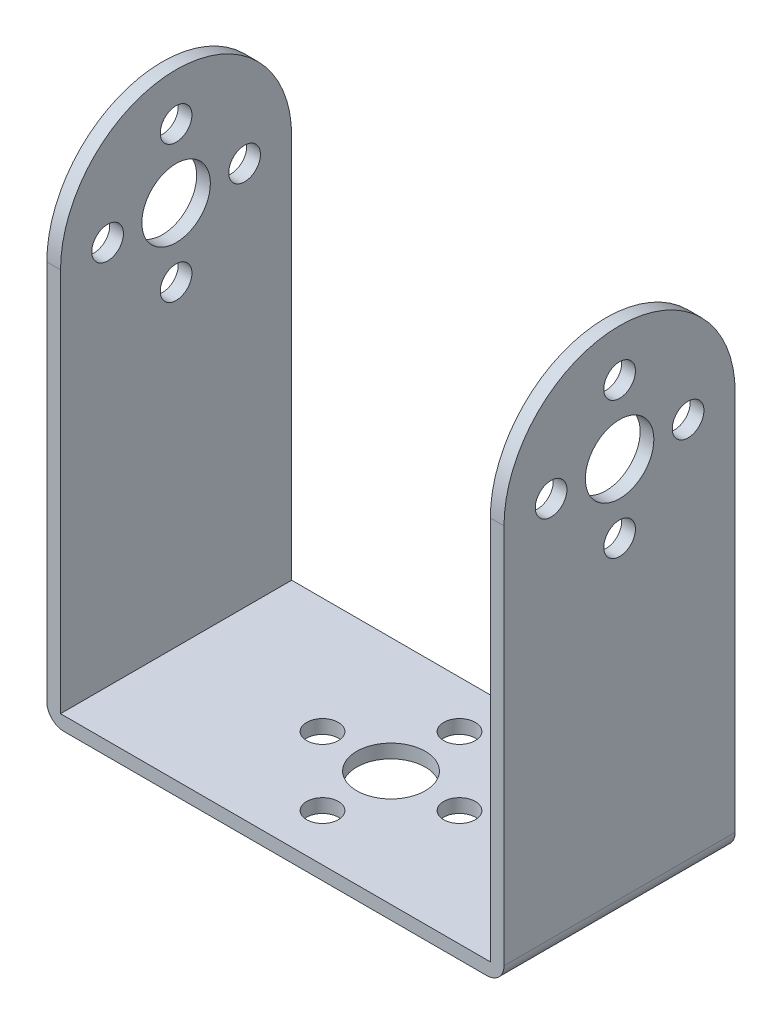
ISO-10303-21;
HEADER;
FILE_DESCRIPTION(('STEP AP214'),'2;1');
FILE_NAME('part.step','',(''),(''),'','','');
FILE_SCHEMA(('AUTOMOTIVE_DESIGN { 1 0 10303 214 1 1 1 1 }'));
ENDSEC;
DATA;
#1=APPLICATION_CONTEXT('core data for automotive mechanical design processes');
#2=APPLICATION_PROTOCOL_DEFINITION('international standard','automotive_design',2000,#1);
#3=PRODUCT_CONTEXT('',#1,'mechanical');
#4=PRODUCT('Part','Part','',(#3));
#5=PRODUCT_RELATED_PRODUCT_CATEGORY('part','',(#4));
#6=PRODUCT_DEFINITION_FORMATION('','',#4);
#7=PRODUCT_DEFINITION_CONTEXT('part definition',#1,'design');
#8=PRODUCT_DEFINITION('design','',#6,#7);
#9=PRODUCT_DEFINITION_SHAPE('','',#8);
#10=(LENGTH_UNIT() NAMED_UNIT(*) SI_UNIT(.MILLI.,.METRE.));
#11=(NAMED_UNIT(*) PLANE_ANGLE_UNIT() SI_UNIT($,.RADIAN.));
#12=(NAMED_UNIT(*) SI_UNIT($,.STERADIAN.) SOLID_ANGLE_UNIT());
#13=UNCERTAINTY_MEASURE_WITH_UNIT(LENGTH_MEASURE(1.E-05),#10,'distance_accuracy_value','');
#14=(GEOMETRIC_REPRESENTATION_CONTEXT(3) GLOBAL_UNCERTAINTY_ASSIGNED_CONTEXT((#13)) GLOBAL_UNIT_ASSIGNED_CONTEXT((#10,
#11,#12)) REPRESENTATION_CONTEXT('',''));
#15=CARTESIAN_POINT('',(0.,0.,0.));
#16=DIRECTION('',(0.,0.,1.));
#17=DIRECTION('',(1.,0.,0.));
#18=AXIS2_PLACEMENT_3D('',#15,#16,#17);
#19=CARTESIAN_POINT('',(-26.7,46.5,0.));
#20=DIRECTION('',(-1.,0.,0.));
#21=DIRECTION('',(0.,0.,1.));
#22=AXIS2_PLACEMENT_3D('',#19,#20,#21);
#23=CYLINDRICAL_SURFACE('',#22,13.5);
#24=DIRECTION('',(1.,0.,0.));
#25=VECTOR('',#24,1.);
#26=CARTESIAN_POINT('',(-26.7,46.5,-13.5));
#27=LINE('',#26,#25);
#28=CARTESIAN_POINT('',(-26.7,46.5,-13.5));
#29=VERTEX_POINT('',#28);
#30=CARTESIAN_POINT('',(-25.1,46.5,-13.5));
#31=VERTEX_POINT('',#30);
#32=EDGE_CURVE('E188',#29,#31,#27,.T.);
#33=ORIENTED_EDGE('',*,*,#32,.F.);
#34=CARTESIAN_POINT('',(-26.7,46.5,0.));
#35=DIRECTION('',(-1.,0.,0.));
#36=DIRECTION('',(0.,-1.,0.));
#37=AXIS2_PLACEMENT_3D('',#34,#35,#36);
#38=CIRCLE('',#37,13.5);
#39=CARTESIAN_POINT('',(-26.7,46.5,13.5));
#40=VERTEX_POINT('',#39);
#41=EDGE_CURVE('E195',#40,#29,#38,.T.);
#42=ORIENTED_EDGE('',*,*,#41,.F.);
#43=DIRECTION('',(-1.,0.,0.));
#44=VECTOR('',#43,1.);
#45=CARTESIAN_POINT('',(-26.7,46.5,13.5));
#46=LINE('',#45,#44);
#47=CARTESIAN_POINT('',(-25.1,46.5,13.5));
#48=VERTEX_POINT('',#47);
#49=EDGE_CURVE('E191',#48,#40,#46,.T.);
#50=ORIENTED_EDGE('',*,*,#49,.F.);
#51=CARTESIAN_POINT('',(-25.1,46.5,0.));
#52=DIRECTION('',(1.,0.,0.));
#53=DIRECTION('',(0.,0.,-1.));
#54=AXIS2_PLACEMENT_3D('',#51,#52,#53);
#55=CIRCLE('',#54,13.5);
#56=EDGE_CURVE('E198',#31,#48,#55,.T.);
#57=ORIENTED_EDGE('',*,*,#56,.F.);
#58=EDGE_LOOP('',(#33,#42,#50,#57));
#59=FACE_BOUND('',#58,.T.);
#60=ADVANCED_FACE('F16',(#59),#23,.T.);
#61=CARTESIAN_POINT('',(26.7,46.5,0.));
#62=DIRECTION('',(-1.,0.,0.));
#63=DIRECTION('',(0.,0.,1.));
#64=AXIS2_PLACEMENT_3D('',#61,#62,#63);
#65=CYLINDRICAL_SURFACE('',#64,13.5);
#66=DIRECTION('',(-1.,0.,0.));
#67=VECTOR('',#66,1.);
#68=CARTESIAN_POINT('',(-26.7,46.5,13.5));
#69=LINE('',#68,#67);
#70=CARTESIAN_POINT('',(26.7,46.5,13.5));
#71=VERTEX_POINT('',#70);
#72=CARTESIAN_POINT('',(25.1,46.5,13.5));
#73=VERTEX_POINT('',#72);
#74=EDGE_CURVE('E174',#71,#73,#69,.T.);
#75=ORIENTED_EDGE('',*,*,#74,.F.);
#76=CARTESIAN_POINT('',(26.7,46.5,0.));
#77=DIRECTION('',(1.,0.,0.));
#78=DIRECTION('',(0.,1.,0.));
#79=AXIS2_PLACEMENT_3D('',#76,#77,#78);
#80=CIRCLE('',#79,13.5);
#81=CARTESIAN_POINT('',(26.7,46.5,-13.5));
#82=VERTEX_POINT('',#81);
#83=EDGE_CURVE('E182',#82,#71,#80,.T.);
#84=ORIENTED_EDGE('',*,*,#83,.F.);
#85=DIRECTION('',(1.,0.,0.));
#86=VECTOR('',#85,1.);
#87=CARTESIAN_POINT('',(26.7,46.5,-13.5));
#88=LINE('',#87,#86);
#89=CARTESIAN_POINT('',(25.1,46.5,-13.5));
#90=VERTEX_POINT('',#89);
#91=EDGE_CURVE('E179',#90,#82,#88,.T.);
#92=ORIENTED_EDGE('',*,*,#91,.F.);
#93=CARTESIAN_POINT('',(25.1,46.5,0.));
#94=DIRECTION('',(-1.,0.,0.));
#95=DIRECTION('',(0.,-1.,0.));
#96=AXIS2_PLACEMENT_3D('',#93,#94,#95);
#97=CIRCLE('',#96,13.5);
#98=EDGE_CURVE('E123',#73,#90,#97,.T.);
#99=ORIENTED_EDGE('',*,*,#98,.F.);
#100=EDGE_LOOP('',(#75,#84,#92,#99));
#101=FACE_BOUND('',#100,.T.);
#102=ADVANCED_FACE('F754',(#101),#65,.T.);
#103=CARTESIAN_POINT('',(-26.7,60.,-13.5));
#104=DIRECTION('',(-1.,0.,0.));
#105=DIRECTION('',(0.,-1.,0.));
#106=AXIS2_PLACEMENT_3D('',#103,#104,#105);
#107=PLANE('',#106);
#108=CARTESIAN_POINT('',(-26.7,54.5,0.));
#109=DIRECTION('',(1.,0.,0.));
#110=DIRECTION('',(0.,0.,-1.));
#111=AXIS2_PLACEMENT_3D('',#108,#109,#110);
#112=CIRCLE('',#111,1.85);
#113=CARTESIAN_POINT('',(-26.7,54.5,-1.85));
#114=VERTEX_POINT('',#113);
#115=EDGE_CURVE('E398',#114,#114,#112,.T.);
#116=ORIENTED_EDGE('',*,*,#115,.T.);
#117=EDGE_LOOP('',(#116));
#118=FACE_BOUND('',#117,.T.);
#119=CARTESIAN_POINT('',(-26.7,38.5,0.));
#120=DIRECTION('',(1.,0.,0.));
#121=DIRECTION('',(0.,0.,-1.));
#122=AXIS2_PLACEMENT_3D('',#119,#120,#121);
#123=CIRCLE('',#122,1.85);
#124=CARTESIAN_POINT('',(-26.7,38.5,-1.85));
#125=VERTEX_POINT('',#124);
#126=EDGE_CURVE('E372',#125,#125,#123,.T.);
#127=ORIENTED_EDGE('',*,*,#126,.T.);
#128=EDGE_LOOP('',(#127));
#129=FACE_BOUND('',#128,.T.);
#130=CARTESIAN_POINT('',(-26.7,46.5,8.));
#131=DIRECTION('',(1.,0.,0.));
#132=DIRECTION('',(0.,0.,-1.));
#133=AXIS2_PLACEMENT_3D('',#130,#131,#132);
#134=CIRCLE('',#133,1.85);
#135=CARTESIAN_POINT('',(-26.7,46.5,6.15));
#136=VERTEX_POINT('',#135);
#137=EDGE_CURVE('E346',#136,#136,#134,.T.);
#138=ORIENTED_EDGE('',*,*,#137,.T.);
#139=EDGE_LOOP('',(#138));
#140=FACE_BOUND('',#139,.T.);
#141=CARTESIAN_POINT('',(-26.7,46.5,-8.));
#142=DIRECTION('',(1.,0.,0.));
#143=DIRECTION('',(0.,0.,-1.));
#144=AXIS2_PLACEMENT_3D('',#141,#142,#143);
#145=CIRCLE('',#144,1.85);
#146=CARTESIAN_POINT('',(-26.7,46.5,-9.85));
#147=VERTEX_POINT('',#146);
#148=EDGE_CURVE('E320',#147,#147,#145,.T.);
#149=ORIENTED_EDGE('',*,*,#148,.T.);
#150=EDGE_LOOP('',(#149));
#151=FACE_BOUND('',#150,.T.);
#152=CARTESIAN_POINT('',(-26.7,46.5,0.));
#153=DIRECTION('',(1.,0.,0.));
#154=DIRECTION('',(0.,0.,-1.));
#155=AXIS2_PLACEMENT_3D('',#152,#153,#154);
#156=CIRCLE('',#155,4.00000000000001);
#157=CARTESIAN_POINT('',(-26.7,46.5,-4.00000000000001));
#158=VERTEX_POINT('',#157);
#159=EDGE_CURVE('E294',#158,#158,#156,.T.);
#160=ORIENTED_EDGE('',*,*,#159,.T.);
#161=EDGE_LOOP('',(#160));
#162=FACE_BOUND('',#161,.T.);
#163=DIRECTION('',(0.,-1.,0.));
#164=VECTOR('',#163,1.);
#165=CARTESIAN_POINT('',(-26.7,60.,-13.5));
#166=LINE('',#165,#164);
#167=CARTESIAN_POINT('',(-26.7,2.00000000000002,-13.5));
#168=VERTEX_POINT('',#167);
#169=EDGE_CURVE('E172',#29,#168,#166,.T.);
#170=ORIENTED_EDGE('',*,*,#169,.T.);
#171=DIRECTION('',(0.,0.,1.));
#172=VECTOR('',#171,1.);
#173=CARTESIAN_POINT('',(-26.7,2.,-13.5));
#174=LINE('',#173,#172);
#175=CARTESIAN_POINT('',(-26.7,2.00000000000002,13.5));
#176=VERTEX_POINT('',#175);
#177=EDGE_CURVE('E215',#168,#176,#174,.T.);
#178=ORIENTED_EDGE('',*,*,#177,.T.);
#179=DIRECTION('',(0.,-1.,0.));
#180=VECTOR('',#179,1.);
#181=CARTESIAN_POINT('',(-26.7,60.,13.5));
#182=LINE('',#181,#180);
#183=EDGE_CURVE('E153',#40,#176,#182,.T.);
#184=ORIENTED_EDGE('',*,*,#183,.F.);
#185=ORIENTED_EDGE('',*,*,#41,.T.);
#186=EDGE_LOOP('',(#170,#178,#184,#185));
#187=FACE_BOUND('',#186,.T.);
#188=ADVANCED_FACE('F744',(#118,#129,#140,#151,#162,#187),#107,.T.);
#189=CARTESIAN_POINT('',(-25.1,1.59999999999999,-13.5));
#190=DIRECTION('',(1.,0.,0.));
#191=DIRECTION('',(0.,0.,-1.));
#192=AXIS2_PLACEMENT_3D('',#189,#190,#191);
#193=PLANE('',#192);
#194=CARTESIAN_POINT('',(-25.1,54.5,0.));
#195=DIRECTION('',(1.,0.,0.));
#196=DIRECTION('',(0.,0.,-1.));
#197=AXIS2_PLACEMENT_3D('',#194,#195,#196);
#198=CIRCLE('',#197,1.85);
#199=CARTESIAN_POINT('',(-25.1,54.5,-1.85));
#200=VERTEX_POINT('',#199);
#201=EDGE_CURVE('E407',#200,#200,#198,.T.);
#202=ORIENTED_EDGE('',*,*,#201,.F.);
#203=EDGE_LOOP('',(#202));
#204=FACE_BOUND('',#203,.T.);
#205=CARTESIAN_POINT('',(-25.1,38.5,0.));
#206=DIRECTION('',(1.,0.,0.));
#207=DIRECTION('',(0.,0.,-1.));
#208=AXIS2_PLACEMENT_3D('',#205,#206,#207);
#209=CIRCLE('',#208,1.85);
#210=CARTESIAN_POINT('',(-25.1,38.5,-1.85));
#211=VERTEX_POINT('',#210);
#212=EDGE_CURVE('E381',#211,#211,#209,.T.);
#213=ORIENTED_EDGE('',*,*,#212,.F.);
#214=EDGE_LOOP('',(#213));
#215=FACE_BOUND('',#214,.T.);
#216=CARTESIAN_POINT('',(-25.1,46.5,8.));
#217=DIRECTION('',(1.,0.,0.));
#218=DIRECTION('',(0.,0.,-1.));
#219=AXIS2_PLACEMENT_3D('',#216,#217,#218);
#220=CIRCLE('',#219,1.85);
#221=CARTESIAN_POINT('',(-25.1,46.5,6.15));
#222=VERTEX_POINT('',#221);
#223=EDGE_CURVE('E355',#222,#222,#220,.T.);
#224=ORIENTED_EDGE('',*,*,#223,.F.);
#225=EDGE_LOOP('',(#224));
#226=FACE_BOUND('',#225,.T.);
#227=CARTESIAN_POINT('',(-25.1,46.5,-8.));
#228=DIRECTION('',(1.,0.,0.));
#229=DIRECTION('',(0.,0.,-1.));
#230=AXIS2_PLACEMENT_3D('',#227,#228,#229);
#231=CIRCLE('',#230,1.85);
#232=CARTESIAN_POINT('',(-25.1,46.5,-9.85));
#233=VERTEX_POINT('',#232);
#234=EDGE_CURVE('E329',#233,#233,#231,.T.);
#235=ORIENTED_EDGE('',*,*,#234,.F.);
#236=EDGE_LOOP('',(#235));
#237=FACE_BOUND('',#236,.T.);
#238=CARTESIAN_POINT('',(-25.1,46.5,0.));
#239=DIRECTION('',(1.,0.,0.));
#240=DIRECTION('',(0.,0.,-1.));
#241=AXIS2_PLACEMENT_3D('',#238,#239,#240);
#242=CIRCLE('',#241,4.00000000000001);
#243=CARTESIAN_POINT('',(-25.1,46.5,-4.00000000000001));
#244=VERTEX_POINT('',#243);
#245=EDGE_CURVE('E303',#244,#244,#242,.T.);
#246=ORIENTED_EDGE('',*,*,#245,.F.);
#247=EDGE_LOOP('',(#246));
#248=FACE_BOUND('',#247,.T.);
#249=DIRECTION('',(0.,1.,0.));
#250=VECTOR('',#249,1.);
#251=CARTESIAN_POINT('',(-25.1,1.59999999999999,-13.5));
#252=LINE('',#251,#250);
#253=CARTESIAN_POINT('',(-25.1,1.59999999999999,-13.5));
#254=VERTEX_POINT('',#253);
#255=EDGE_CURVE('E139',#254,#31,#252,.T.);
#256=ORIENTED_EDGE('',*,*,#255,.T.);
#257=ORIENTED_EDGE('',*,*,#56,.T.);
#258=DIRECTION('',(0.,1.,0.));
#259=VECTOR('',#258,1.);
#260=CARTESIAN_POINT('',(-25.1,1.59999999999999,13.5));
#261=LINE('',#260,#259);
#262=CARTESIAN_POINT('',(-25.1,1.59999999999999,13.5));
#263=VERTEX_POINT('',#262);
#264=EDGE_CURVE('E168',#263,#48,#261,.T.);
#265=ORIENTED_EDGE('',*,*,#264,.F.);
#266=DIRECTION('',(0.,0.,1.));
#267=VECTOR('',#266,1.);
#268=CARTESIAN_POINT('',(-25.1,1.59999999999999,-13.5));
#269=LINE('',#268,#267);
#270=EDGE_CURVE('E138',#254,#263,#269,.T.);
#271=ORIENTED_EDGE('',*,*,#270,.F.);
#272=EDGE_LOOP('',(#256,#257,#265,#271));
#273=FACE_BOUND('',#272,.T.);
#274=ADVANCED_FACE('F733',(#204,#215,#226,#237,#248,#273),#193,.T.);
#275=CARTESIAN_POINT('',(25.1,1.6,-13.5));
#276=DIRECTION('',(0.,1.,0.));
#277=DIRECTION('',(-1.,0.,0.));
#278=AXIS2_PLACEMENT_3D('',#275,#276,#277);
#279=PLANE('',#278);
#280=CARTESIAN_POINT('',(0.,1.6,8.));
#281=DIRECTION('',(0.,1.,0.));
#282=DIRECTION('',(-1.,0.,0.));
#283=AXIS2_PLACEMENT_3D('',#280,#281,#282);
#284=CIRCLE('',#283,1.85);
#285=CARTESIAN_POINT('',(-1.85,1.6,8.));
#286=VERTEX_POINT('',#285);
#287=EDGE_CURVE('E472',#286,#286,#284,.T.);
#288=ORIENTED_EDGE('',*,*,#287,.F.);
#289=EDGE_LOOP('',(#288));
#290=FACE_BOUND('',#289,.T.);
#291=CARTESIAN_POINT('',(0.,1.6,-8.));
#292=DIRECTION('',(0.,1.,0.));
#293=DIRECTION('',(-1.,0.,0.));
#294=AXIS2_PLACEMENT_3D('',#291,#292,#293);
#295=CIRCLE('',#294,1.85);
#296=CARTESIAN_POINT('',(-1.85,1.6,-8.));
#297=VERTEX_POINT('',#296);
#298=EDGE_CURVE('E459',#297,#297,#295,.T.);
#299=ORIENTED_EDGE('',*,*,#298,.F.);
#300=EDGE_LOOP('',(#299));
#301=FACE_BOUND('',#300,.T.);
#302=CARTESIAN_POINT('',(-8.,1.6,0.));
#303=DIRECTION('',(0.,1.,0.));
#304=DIRECTION('',(-1.,0.,0.));
#305=AXIS2_PLACEMENT_3D('',#302,#303,#304);
#306=CIRCLE('',#305,1.85);
#307=CARTESIAN_POINT('',(-9.85,1.6,0.));
#308=VERTEX_POINT('',#307);
#309=EDGE_CURVE('E446',#308,#308,#306,.T.);
#310=ORIENTED_EDGE('',*,*,#309,.F.);
#311=EDGE_LOOP('',(#310));
#312=FACE_BOUND('',#311,.T.);
#313=CARTESIAN_POINT('',(8.,1.6,0.));
#314=DIRECTION('',(0.,1.,0.));
#315=DIRECTION('',(-1.,0.,0.));
#316=AXIS2_PLACEMENT_3D('',#313,#314,#315);
#317=CIRCLE('',#316,1.85);
#318=CARTESIAN_POINT('',(6.15,1.6,0.));
#319=VERTEX_POINT('',#318);
#320=EDGE_CURVE('E433',#319,#319,#317,.T.);
#321=ORIENTED_EDGE('',*,*,#320,.F.);
#322=EDGE_LOOP('',(#321));
#323=FACE_BOUND('',#322,.T.);
#324=CARTESIAN_POINT('',(0.,1.6,0.));
#325=DIRECTION('',(0.,1.,0.));
#326=DIRECTION('',(-1.,0.,0.));
#327=AXIS2_PLACEMENT_3D('',#324,#325,#326);
#328=CIRCLE('',#327,4.);
#329=CARTESIAN_POINT('',(-4.,1.6,0.));
#330=VERTEX_POINT('',#329);
#331=EDGE_CURVE('E420',#330,#330,#328,.T.);
#332=ORIENTED_EDGE('',*,*,#331,.F.);
#333=EDGE_LOOP('',(#332));
#334=FACE_BOUND('',#333,.T.);
#335=DIRECTION('',(-1.,0.,0.));
#336=VECTOR('',#335,1.);
#337=CARTESIAN_POINT('',(25.1,1.6,13.5));
#338=LINE('',#337,#336);
#339=CARTESIAN_POINT('',(25.1,1.6,13.5));
#340=VERTEX_POINT('',#339);
#341=EDGE_CURVE('E136',#340,#263,#338,.T.);
#342=ORIENTED_EDGE('',*,*,#341,.F.);
#343=DIRECTION('',(0.,0.,1.));
#344=VECTOR('',#343,1.);
#345=CARTESIAN_POINT('',(25.1,1.6,-13.5));
#346=LINE('',#345,#344);
#347=CARTESIAN_POINT('',(25.1,1.6,-13.5));
#348=VERTEX_POINT('',#347);
#349=EDGE_CURVE('E121',#348,#340,#346,.T.);
#350=ORIENTED_EDGE('',*,*,#349,.F.);
#351=DIRECTION('',(-1.,0.,0.));
#352=VECTOR('',#351,1.);
#353=CARTESIAN_POINT('',(25.1,1.6,-13.5));
#354=LINE('',#353,#352);
#355=EDGE_CURVE('E129',#348,#254,#354,.T.);
#356=ORIENTED_EDGE('',*,*,#355,.T.);
#357=ORIENTED_EDGE('',*,*,#270,.T.);
#358=EDGE_LOOP('',(#342,#350,#356,#357));
#359=FACE_BOUND('',#358,.T.);
#360=ADVANCED_FACE('F134',(#290,#301,#312,#323,#334,#359),#279,.T.);
#361=CARTESIAN_POINT('',(25.1,60.,-13.5));
#362=DIRECTION('',(-1.,0.,0.));
#363=DIRECTION('',(0.,-1.,0.));
#364=AXIS2_PLACEMENT_3D('',#361,#362,#363);
#365=PLANE('',#364);
#366=CARTESIAN_POINT('',(25.1,54.5,0.));
#367=DIRECTION('',(-1.,0.,0.));
#368=DIRECTION('',(0.,-1.,0.));
#369=AXIS2_PLACEMENT_3D('',#366,#367,#368);
#370=CIRCLE('',#369,1.85);
#371=CARTESIAN_POINT('',(25.1,52.65,0.));
#372=VERTEX_POINT('',#371);
#373=EDGE_CURVE('E394',#372,#372,#370,.T.);
#374=ORIENTED_EDGE('',*,*,#373,.F.);
#375=EDGE_LOOP('',(#374));
#376=FACE_BOUND('',#375,.T.);
#377=CARTESIAN_POINT('',(25.1,38.5,0.));
#378=DIRECTION('',(-1.,0.,0.));
#379=DIRECTION('',(0.,-1.,0.));
#380=AXIS2_PLACEMENT_3D('',#377,#378,#379);
#381=CIRCLE('',#380,1.85);
#382=CARTESIAN_POINT('',(25.1,36.65,0.));
#383=VERTEX_POINT('',#382);
#384=EDGE_CURVE('E368',#383,#383,#381,.T.);
#385=ORIENTED_EDGE('',*,*,#384,.F.);
#386=EDGE_LOOP('',(#385));
#387=FACE_BOUND('',#386,.T.);
#388=CARTESIAN_POINT('',(25.1,46.5,8.));
#389=DIRECTION('',(-1.,0.,0.));
#390=DIRECTION('',(0.,-1.,0.));
#391=AXIS2_PLACEMENT_3D('',#388,#389,#390);
#392=CIRCLE('',#391,1.85);
#393=CARTESIAN_POINT('',(25.1,44.65,8.));
#394=VERTEX_POINT('',#393);
#395=EDGE_CURVE('E342',#394,#394,#392,.T.);
#396=ORIENTED_EDGE('',*,*,#395,.F.);
#397=EDGE_LOOP('',(#396));
#398=FACE_BOUND('',#397,.T.);
#399=CARTESIAN_POINT('',(25.1,46.5,-8.));
#400=DIRECTION('',(-1.,0.,0.));
#401=DIRECTION('',(0.,-1.,0.));
#402=AXIS2_PLACEMENT_3D('',#399,#400,#401);
#403=CIRCLE('',#402,1.85);
#404=CARTESIAN_POINT('',(25.1,44.65,-8.));
#405=VERTEX_POINT('',#404);
#406=EDGE_CURVE('E316',#405,#405,#403,.T.);
#407=ORIENTED_EDGE('',*,*,#406,.F.);
#408=EDGE_LOOP('',(#407));
#409=FACE_BOUND('',#408,.T.);
#410=CARTESIAN_POINT('',(25.1,46.5,0.));
#411=DIRECTION('',(-1.,0.,0.));
#412=DIRECTION('',(0.,-1.,0.));
#413=AXIS2_PLACEMENT_3D('',#410,#411,#412);
#414=CIRCLE('',#413,4.00000000000001);
#415=CARTESIAN_POINT('',(25.1,42.5,0.));
#416=VERTEX_POINT('',#415);
#417=EDGE_CURVE('E290',#416,#416,#414,.T.);
#418=ORIENTED_EDGE('',*,*,#417,.F.);
#419=EDGE_LOOP('',(#418));
#420=FACE_BOUND('',#419,.T.);
#421=DIRECTION('',(0.,-1.,0.));
#422=VECTOR('',#421,1.);
#423=CARTESIAN_POINT('',(25.1,60.,13.5));
#424=LINE('',#423,#422);
#425=EDGE_CURVE('E163',#73,#340,#424,.T.);
#426=ORIENTED_EDGE('',*,*,#425,.F.);
#427=ORIENTED_EDGE('',*,*,#98,.T.);
#428=DIRECTION('',(0.,-1.,0.));
#429=VECTOR('',#428,1.);
#430=CARTESIAN_POINT('',(25.1,60.,-13.5));
#431=LINE('',#430,#429);
#432=EDGE_CURVE('E117',#90,#348,#431,.T.);
#433=ORIENTED_EDGE('',*,*,#432,.T.);
#434=ORIENTED_EDGE('',*,*,#349,.T.);
#435=EDGE_LOOP('',(#426,#427,#433,#434));
#436=FACE_BOUND('',#435,.T.);
#437=ADVANCED_FACE('F120',(#376,#387,#398,#409,#420,#436),#365,.T.);
#438=CARTESIAN_POINT('',(26.7,0.,-13.5));
#439=DIRECTION('',(1.,0.,0.));
#440=DIRECTION('',(0.,1.,0.));
#441=AXIS2_PLACEMENT_3D('',#438,#439,#440);
#442=PLANE('',#441);
#443=CARTESIAN_POINT('',(26.7,54.5,0.));
#444=DIRECTION('',(1.,0.,0.));
#445=DIRECTION('',(0.,0.,-1.));
#446=AXIS2_PLACEMENT_3D('',#443,#444,#445);
#447=CIRCLE('',#446,1.85);
#448=CARTESIAN_POINT('',(26.7,54.5,-1.85));
#449=VERTEX_POINT('',#448);
#450=EDGE_CURVE('E385',#449,#449,#447,.T.);
#451=ORIENTED_EDGE('',*,*,#450,.F.);
#452=EDGE_LOOP('',(#451));
#453=FACE_BOUND('',#452,.T.);
#454=CARTESIAN_POINT('',(26.7,38.5,0.));
#455=DIRECTION('',(1.,0.,0.));
#456=DIRECTION('',(0.,0.,-1.));
#457=AXIS2_PLACEMENT_3D('',#454,#455,#456);
#458=CIRCLE('',#457,1.85);
#459=CARTESIAN_POINT('',(26.7,38.5,-1.85));
#460=VERTEX_POINT('',#459);
#461=EDGE_CURVE('E359',#460,#460,#458,.T.);
#462=ORIENTED_EDGE('',*,*,#461,.F.);
#463=EDGE_LOOP('',(#462));
#464=FACE_BOUND('',#463,.T.);
#465=CARTESIAN_POINT('',(26.7,46.5,8.));
#466=DIRECTION('',(1.,0.,0.));
#467=DIRECTION('',(0.,0.,-1.));
#468=AXIS2_PLACEMENT_3D('',#465,#466,#467);
#469=CIRCLE('',#468,1.85);
#470=CARTESIAN_POINT('',(26.7,46.5,6.15));
#471=VERTEX_POINT('',#470);
#472=EDGE_CURVE('E333',#471,#471,#469,.T.);
#473=ORIENTED_EDGE('',*,*,#472,.F.);
#474=EDGE_LOOP('',(#473));
#475=FACE_BOUND('',#474,.T.);
#476=CARTESIAN_POINT('',(26.7,46.5,-8.));
#477=DIRECTION('',(1.,0.,0.));
#478=DIRECTION('',(0.,0.,-1.));
#479=AXIS2_PLACEMENT_3D('',#476,#477,#478);
#480=CIRCLE('',#479,1.85);
#481=CARTESIAN_POINT('',(26.7,46.5,-9.85));
#482=VERTEX_POINT('',#481);
#483=EDGE_CURVE('E307',#482,#482,#480,.T.);
#484=ORIENTED_EDGE('',*,*,#483,.F.);
#485=EDGE_LOOP('',(#484));
#486=FACE_BOUND('',#485,.T.);
#487=CARTESIAN_POINT('',(26.7,46.5,0.));
#488=DIRECTION('',(1.,0.,0.));
#489=DIRECTION('',(0.,0.,-1.));
#490=AXIS2_PLACEMENT_3D('',#487,#488,#489);
#491=CIRCLE('',#490,4.00000000000001);
#492=CARTESIAN_POINT('',(26.7,46.5,-4.00000000000001));
#493=VERTEX_POINT('',#492);
#494=EDGE_CURVE('E157',#493,#493,#491,.T.);
#495=ORIENTED_EDGE('',*,*,#494,.F.);
#496=EDGE_LOOP('',(#495));
#497=FACE_BOUND('',#496,.T.);
#498=DIRECTION('',(0.,1.,0.));
#499=VECTOR('',#498,1.);
#500=CARTESIAN_POINT('',(26.7,0.,13.5));
#501=LINE('',#500,#499);
#502=CARTESIAN_POINT('',(26.7,2.00000000000001,13.5));
#503=VERTEX_POINT('',#502);
#504=EDGE_CURVE('E160',#503,#71,#501,.T.);
#505=ORIENTED_EDGE('',*,*,#504,.F.);
#506=DIRECTION('',(0.,0.,1.));
#507=VECTOR('',#506,1.);
#508=CARTESIAN_POINT('',(26.7,2.00000000000001,-13.5));
#509=LINE('',#508,#507);
#510=CARTESIAN_POINT('',(26.7,2.00000000000001,-13.5));
#511=VERTEX_POINT('',#510);
#512=EDGE_CURVE('E208',#503,#511,#509,.F.);
#513=ORIENTED_EDGE('',*,*,#512,.T.);
#514=DIRECTION('',(0.,1.,0.));
#515=VECTOR('',#514,1.);
#516=CARTESIAN_POINT('',(26.7,0.,-13.5));
#517=LINE('',#516,#515);
#518=EDGE_CURVE('E130',#511,#82,#517,.T.);
#519=ORIENTED_EDGE('',*,*,#518,.T.);
#520=ORIENTED_EDGE('',*,*,#83,.T.);
#521=EDGE_LOOP('',(#505,#513,#519,#520));
#522=FACE_BOUND('',#521,.T.);
#523=ADVANCED_FACE('F702',(#453,#464,#475,#486,#497,#522),#442,.T.);
#524=CARTESIAN_POINT('',(-26.7,0.,-13.5));
#525=DIRECTION('',(0.,-1.,0.));
#526=DIRECTION('',(1.,0.,0.));
#527=AXIS2_PLACEMENT_3D('',#524,#525,#526);
#528=PLANE('',#527);
#529=CARTESIAN_POINT('',(0.,0.,8.));
#530=DIRECTION('',(0.,-1.,0.));
#531=DIRECTION('',(0.,0.,-1.));
#532=AXIS2_PLACEMENT_3D('',#529,#530,#531);
#533=CIRCLE('',#532,1.85);
#534=CARTESIAN_POINT('',(0.,0.,6.15));
#535=VERTEX_POINT('',#534);
#536=EDGE_CURVE('E463',#535,#535,#533,.T.);
#537=ORIENTED_EDGE('',*,*,#536,.F.);
#538=EDGE_LOOP('',(#537));
#539=FACE_BOUND('',#538,.T.);
#540=CARTESIAN_POINT('',(0.,0.,-8.));
#541=DIRECTION('',(0.,-1.,0.));
#542=DIRECTION('',(0.,0.,-1.));
#543=AXIS2_PLACEMENT_3D('',#540,#541,#542);
#544=CIRCLE('',#543,1.85);
#545=CARTESIAN_POINT('',(0.,0.,-9.85));
#546=VERTEX_POINT('',#545);
#547=EDGE_CURVE('E450',#546,#546,#544,.T.);
#548=ORIENTED_EDGE('',*,*,#547,.F.);
#549=EDGE_LOOP('',(#548));
#550=FACE_BOUND('',#549,.T.);
#551=CARTESIAN_POINT('',(-8.,0.,0.));
#552=DIRECTION('',(0.,-1.,0.));
#553=DIRECTION('',(0.,0.,-1.));
#554=AXIS2_PLACEMENT_3D('',#551,#552,#553);
#555=CIRCLE('',#554,1.85);
#556=CARTESIAN_POINT('',(-8.,0.,-1.85));
#557=VERTEX_POINT('',#556);
#558=EDGE_CURVE('E437',#557,#557,#555,.T.);
#559=ORIENTED_EDGE('',*,*,#558,.F.);
#560=EDGE_LOOP('',(#559));
#561=FACE_BOUND('',#560,.T.);
#562=CARTESIAN_POINT('',(8.,0.,0.));
#563=DIRECTION('',(0.,-1.,0.));
#564=DIRECTION('',(0.,0.,-1.));
#565=AXIS2_PLACEMENT_3D('',#562,#563,#564);
#566=CIRCLE('',#565,1.85);
#567=CARTESIAN_POINT('',(8.,0.,-1.85));
#568=VERTEX_POINT('',#567);
#569=EDGE_CURVE('E424',#568,#568,#566,.T.);
#570=ORIENTED_EDGE('',*,*,#569,.F.);
#571=EDGE_LOOP('',(#570));
#572=FACE_BOUND('',#571,.T.);
#573=CARTESIAN_POINT('',(0.,0.,0.));
#574=DIRECTION('',(0.,-1.,0.));
#575=DIRECTION('',(0.,0.,-1.));
#576=AXIS2_PLACEMENT_3D('',#573,#574,#575);
#577=CIRCLE('',#576,4.);
#578=CARTESIAN_POINT('',(0.,0.,-4.));
#579=VERTEX_POINT('',#578);
#580=EDGE_CURVE('E411',#579,#579,#577,.T.);
#581=ORIENTED_EDGE('',*,*,#580,.F.);
#582=EDGE_LOOP('',(#581));
#583=FACE_BOUND('',#582,.T.);
#584=DIRECTION('',(1.,0.,0.));
#585=VECTOR('',#584,1.);
#586=CARTESIAN_POINT('',(-26.7,0.,13.5));
#587=LINE('',#586,#585);
#588=CARTESIAN_POINT('',(-24.7,0.,13.5));
#589=VERTEX_POINT('',#588);
#590=CARTESIAN_POINT('',(24.7,0.,13.5));
#591=VERTEX_POINT('',#590);
#592=EDGE_CURVE('E156',#589,#591,#587,.T.);
#593=ORIENTED_EDGE('',*,*,#592,.F.);
#594=DIRECTION('',(0.,0.,1.));
#595=VECTOR('',#594,1.);
#596=CARTESIAN_POINT('',(-24.7,0.,-13.5));
#597=LINE('',#596,#595);
#598=CARTESIAN_POINT('',(-24.7,0.,-13.5));
#599=VERTEX_POINT('',#598);
#600=EDGE_CURVE('E25',#589,#599,#597,.F.);
#601=ORIENTED_EDGE('',*,*,#600,.T.);
#602=DIRECTION('',(1.,0.,0.));
#603=VECTOR('',#602,1.);
#604=CARTESIAN_POINT('',(-26.7,0.,-13.5));
#605=LINE('',#604,#603);
#606=CARTESIAN_POINT('',(24.7,0.,-13.5));
#607=VERTEX_POINT('',#606);
#608=EDGE_CURVE('E269',#599,#607,#605,.T.);
#609=ORIENTED_EDGE('',*,*,#608,.T.);
#610=DIRECTION('',(0.,0.,1.));
#611=VECTOR('',#610,1.);
#612=CARTESIAN_POINT('',(24.7,0.,-13.5));
#613=LINE('',#612,#611);
#614=EDGE_CURVE('E201',#607,#591,#613,.T.);
#615=ORIENTED_EDGE('',*,*,#614,.T.);
#616=EDGE_LOOP('',(#593,#601,#609,#615));
#617=FACE_BOUND('',#616,.T.);
#618=ADVANCED_FACE('F691',(#539,#550,#561,#572,#583,#617),#528,.T.);
#619=CARTESIAN_POINT('',(-26.7,0.,-13.5));
#620=DIRECTION('',(0.,0.,1.));
#621=DIRECTION('',(1.,0.,0.));
#622=AXIS2_PLACEMENT_3D('',#619,#620,#621);
#623=PLANE('',#622);
#624=ORIENTED_EDGE('',*,*,#608,.F.);
#625=CARTESIAN_POINT('',(-24.7,2.,-13.5));
#626=DIRECTION('',(0.,0.,1.));
#627=DIRECTION('',(1.,0.,0.));
#628=AXIS2_PLACEMENT_3D('',#625,#626,#627);
#629=CIRCLE('',#628,2.);
#630=EDGE_CURVE('E10',#599,#168,#629,.F.);
#631=ORIENTED_EDGE('',*,*,#630,.T.);
#632=ORIENTED_EDGE('',*,*,#169,.F.);
#633=ORIENTED_EDGE('',*,*,#32,.T.);
#634=ORIENTED_EDGE('',*,*,#255,.F.);
#635=ORIENTED_EDGE('',*,*,#355,.F.);
#636=ORIENTED_EDGE('',*,*,#432,.F.);
#637=ORIENTED_EDGE('',*,*,#91,.T.);
#638=ORIENTED_EDGE('',*,*,#518,.F.);
#639=CARTESIAN_POINT('',(24.7,2.00000000000001,-13.5));
#640=DIRECTION('',(0.,0.,1.));
#641=DIRECTION('',(1.,0.,0.));
#642=AXIS2_PLACEMENT_3D('',#639,#640,#641);
#643=CIRCLE('',#642,2.);
#644=EDGE_CURVE('E211',#511,#607,#643,.F.);
#645=ORIENTED_EDGE('',*,*,#644,.T.);
#646=EDGE_LOOP('',(#624,#631,#632,#633,#634,#635,#636,#637,#638,#645));
#647=FACE_BOUND('',#646,.T.);
#648=ADVANCED_FACE('F142',(#647),#623,.F.);
#649=CARTESIAN_POINT('',(-26.7,0.,13.5));
#650=DIRECTION('',(0.,0.,1.));
#651=DIRECTION('',(1.,0.,0.));
#652=AXIS2_PLACEMENT_3D('',#649,#650,#651);
#653=PLANE('',#652);
#654=ORIENTED_EDGE('',*,*,#183,.T.);
#655=CARTESIAN_POINT('',(-24.7,2.,13.5));
#656=DIRECTION('',(0.,0.,1.));
#657=DIRECTION('',(1.,0.,0.));
#658=AXIS2_PLACEMENT_3D('',#655,#656,#657);
#659=CIRCLE('',#658,2.);
#660=EDGE_CURVE('E46',#176,#589,#659,.T.);
#661=ORIENTED_EDGE('',*,*,#660,.T.);
#662=ORIENTED_EDGE('',*,*,#592,.T.);
#663=CARTESIAN_POINT('',(24.7,2.00000000000001,13.5));
#664=DIRECTION('',(0.,0.,1.));
#665=DIRECTION('',(1.,0.,0.));
#666=AXIS2_PLACEMENT_3D('',#663,#664,#665);
#667=CIRCLE('',#666,2.);
#668=EDGE_CURVE('E205',#591,#503,#667,.T.);
#669=ORIENTED_EDGE('',*,*,#668,.T.);
#670=ORIENTED_EDGE('',*,*,#504,.T.);
#671=ORIENTED_EDGE('',*,*,#74,.T.);
#672=ORIENTED_EDGE('',*,*,#425,.T.);
#673=ORIENTED_EDGE('',*,*,#341,.T.);
#674=ORIENTED_EDGE('',*,*,#264,.T.);
#675=ORIENTED_EDGE('',*,*,#49,.T.);
#676=EDGE_LOOP('',(#654,#661,#662,#669,#670,#671,#672,#673,#674,#675));
#677=FACE_BOUND('',#676,.T.);
#678=ADVANCED_FACE('F672',(#677),#653,.T.);
#679=CARTESIAN_POINT('',(24.7,2.00000000000001,-13.5));
#680=DIRECTION('',(0.,0.,1.));
#681=DIRECTION('',(1.,0.,0.));
#682=AXIS2_PLACEMENT_3D('',#679,#680,#681);
#683=CYLINDRICAL_SURFACE('',#682,2.);
#684=ORIENTED_EDGE('',*,*,#644,.F.);
#685=ORIENTED_EDGE('',*,*,#512,.F.);
#686=ORIENTED_EDGE('',*,*,#668,.F.);
#687=ORIENTED_EDGE('',*,*,#614,.F.);
#688=EDGE_LOOP('',(#684,#685,#686,#687));
#689=FACE_BOUND('',#688,.T.);
#690=ADVANCED_FACE('F660',(#689),#683,.T.);
#691=CARTESIAN_POINT('',(-24.7,2.,-13.5));
#692=DIRECTION('',(0.,0.,1.));
#693=DIRECTION('',(1.,0.,0.));
#694=AXIS2_PLACEMENT_3D('',#691,#692,#693);
#695=CYLINDRICAL_SURFACE('',#694,2.);
#696=ORIENTED_EDGE('',*,*,#630,.F.);
#697=ORIENTED_EDGE('',*,*,#600,.F.);
#698=ORIENTED_EDGE('',*,*,#660,.F.);
#699=ORIENTED_EDGE('',*,*,#177,.F.);
#700=EDGE_LOOP('',(#696,#697,#698,#699));
#701=FACE_BOUND('',#700,.T.);
#702=ADVANCED_FACE('F18',(#701),#695,.T.);
#703=CARTESIAN_POINT('',(-26.7,46.5,0.));
#704=DIRECTION('',(1.,0.,0.));
#705=DIRECTION('',(0.,0.,-1.));
#706=AXIS2_PLACEMENT_3D('',#703,#704,#705);
#707=CYLINDRICAL_SURFACE('',#706,4.00000000000001);
#708=ORIENTED_EDGE('',*,*,#417,.T.);
#709=EDGE_LOOP('',(#708));
#710=FACE_BOUND('',#709,.T.);
#711=ORIENTED_EDGE('',*,*,#494,.T.);
#712=EDGE_LOOP('',(#711));
#713=FACE_BOUND('',#712,.T.);
#714=ADVANCED_FACE('F638',(#710,#713),#707,.F.);
#715=CARTESIAN_POINT('',(-26.7,46.5,0.));
#716=DIRECTION('',(1.,0.,0.));
#717=DIRECTION('',(0.,0.,-1.));
#718=AXIS2_PLACEMENT_3D('',#715,#716,#717);
#719=CYLINDRICAL_SURFACE('',#718,4.00000000000001);
#720=ORIENTED_EDGE('',*,*,#245,.T.);
#721=EDGE_LOOP('',(#720));
#722=FACE_BOUND('',#721,.T.);
#723=ORIENTED_EDGE('',*,*,#159,.F.);
#724=EDGE_LOOP('',(#723));
#725=FACE_BOUND('',#724,.T.);
#726=ADVANCED_FACE('F627',(#722,#725),#719,.F.);
#727=CARTESIAN_POINT('',(-26.7,46.5,-8.));
#728=DIRECTION('',(1.,0.,0.));
#729=DIRECTION('',(0.,0.,-1.));
#730=AXIS2_PLACEMENT_3D('',#727,#728,#729);
#731=CYLINDRICAL_SURFACE('',#730,1.85);
#732=ORIENTED_EDGE('',*,*,#406,.T.);
#733=EDGE_LOOP('',(#732));
#734=FACE_BOUND('',#733,.T.);
#735=ORIENTED_EDGE('',*,*,#483,.T.);
#736=EDGE_LOOP('',(#735));
#737=FACE_BOUND('',#736,.T.);
#738=ADVANCED_FACE('F616',(#734,#737),#731,.F.);
#739=CARTESIAN_POINT('',(-26.7,46.5,-8.));
#740=DIRECTION('',(1.,0.,0.));
#741=DIRECTION('',(0.,0.,-1.));
#742=AXIS2_PLACEMENT_3D('',#739,#740,#741);
#743=CYLINDRICAL_SURFACE('',#742,1.85);
#744=ORIENTED_EDGE('',*,*,#234,.T.);
#745=EDGE_LOOP('',(#744));
#746=FACE_BOUND('',#745,.T.);
#747=ORIENTED_EDGE('',*,*,#148,.F.);
#748=EDGE_LOOP('',(#747));
#749=FACE_BOUND('',#748,.T.);
#750=ADVANCED_FACE('F605',(#746,#749),#743,.F.);
#751=CARTESIAN_POINT('',(-26.7,46.5,8.));
#752=DIRECTION('',(1.,0.,0.));
#753=DIRECTION('',(0.,0.,-1.));
#754=AXIS2_PLACEMENT_3D('',#751,#752,#753);
#755=CYLINDRICAL_SURFACE('',#754,1.85);
#756=ORIENTED_EDGE('',*,*,#395,.T.);
#757=EDGE_LOOP('',(#756));
#758=FACE_BOUND('',#757,.T.);
#759=ORIENTED_EDGE('',*,*,#472,.T.);
#760=EDGE_LOOP('',(#759));
#761=FACE_BOUND('',#760,.T.);
#762=ADVANCED_FACE('F594',(#758,#761),#755,.F.);
#763=CARTESIAN_POINT('',(-26.7,46.5,8.));
#764=DIRECTION('',(1.,0.,0.));
#765=DIRECTION('',(0.,0.,-1.));
#766=AXIS2_PLACEMENT_3D('',#763,#764,#765);
#767=CYLINDRICAL_SURFACE('',#766,1.85);
#768=ORIENTED_EDGE('',*,*,#223,.T.);
#769=EDGE_LOOP('',(#768));
#770=FACE_BOUND('',#769,.T.);
#771=ORIENTED_EDGE('',*,*,#137,.F.);
#772=EDGE_LOOP('',(#771));
#773=FACE_BOUND('',#772,.T.);
#774=ADVANCED_FACE('F583',(#770,#773),#767,.F.);
#775=CARTESIAN_POINT('',(-26.7,38.5,0.));
#776=DIRECTION('',(1.,0.,0.));
#777=DIRECTION('',(0.,0.,-1.));
#778=AXIS2_PLACEMENT_3D('',#775,#776,#777);
#779=CYLINDRICAL_SURFACE('',#778,1.85);
#780=ORIENTED_EDGE('',*,*,#384,.T.);
#781=EDGE_LOOP('',(#780));
#782=FACE_BOUND('',#781,.T.);
#783=ORIENTED_EDGE('',*,*,#461,.T.);
#784=EDGE_LOOP('',(#783));
#785=FACE_BOUND('',#784,.T.);
#786=ADVANCED_FACE('F572',(#782,#785),#779,.F.);
#787=CARTESIAN_POINT('',(-26.7,38.5,0.));
#788=DIRECTION('',(1.,0.,0.));
#789=DIRECTION('',(0.,0.,-1.));
#790=AXIS2_PLACEMENT_3D('',#787,#788,#789);
#791=CYLINDRICAL_SURFACE('',#790,1.85);
#792=ORIENTED_EDGE('',*,*,#212,.T.);
#793=EDGE_LOOP('',(#792));
#794=FACE_BOUND('',#793,.T.);
#795=ORIENTED_EDGE('',*,*,#126,.F.);
#796=EDGE_LOOP('',(#795));
#797=FACE_BOUND('',#796,.T.);
#798=ADVANCED_FACE('F561',(#794,#797),#791,.F.);
#799=CARTESIAN_POINT('',(-26.7,54.5,0.));
#800=DIRECTION('',(1.,0.,0.));
#801=DIRECTION('',(0.,0.,-1.));
#802=AXIS2_PLACEMENT_3D('',#799,#800,#801);
#803=CYLINDRICAL_SURFACE('',#802,1.85);
#804=ORIENTED_EDGE('',*,*,#373,.T.);
#805=EDGE_LOOP('',(#804));
#806=FACE_BOUND('',#805,.T.);
#807=ORIENTED_EDGE('',*,*,#450,.T.);
#808=EDGE_LOOP('',(#807));
#809=FACE_BOUND('',#808,.T.);
#810=ADVANCED_FACE('F550',(#806,#809),#803,.F.);
#811=CARTESIAN_POINT('',(-26.7,54.5,0.));
#812=DIRECTION('',(1.,0.,0.));
#813=DIRECTION('',(0.,0.,-1.));
#814=AXIS2_PLACEMENT_3D('',#811,#812,#813);
#815=CYLINDRICAL_SURFACE('',#814,1.85);
#816=ORIENTED_EDGE('',*,*,#201,.T.);
#817=EDGE_LOOP('',(#816));
#818=FACE_BOUND('',#817,.T.);
#819=ORIENTED_EDGE('',*,*,#115,.F.);
#820=EDGE_LOOP('',(#819));
#821=FACE_BOUND('',#820,.T.);
#822=ADVANCED_FACE('F539',(#818,#821),#815,.F.);
#823=CARTESIAN_POINT('',(0.,27.,0.));
#824=DIRECTION('',(0.,-1.,0.));
#825=DIRECTION('',(0.,0.,-1.));
#826=AXIS2_PLACEMENT_3D('',#823,#824,#825);
#827=CYLINDRICAL_SURFACE('',#826,4.);
#828=ORIENTED_EDGE('',*,*,#331,.T.);
#829=EDGE_LOOP('',(#828));
#830=FACE_BOUND('',#829,.T.);
#831=ORIENTED_EDGE('',*,*,#580,.T.);
#832=EDGE_LOOP('',(#831));
#833=FACE_BOUND('',#832,.T.);
#834=ADVANCED_FACE('F528',(#830,#833),#827,.F.);
#835=CARTESIAN_POINT('',(8.,27.,0.));
#836=DIRECTION('',(0.,-1.,0.));
#837=DIRECTION('',(0.,0.,-1.));
#838=AXIS2_PLACEMENT_3D('',#835,#836,#837);
#839=CYLINDRICAL_SURFACE('',#838,1.85);
#840=ORIENTED_EDGE('',*,*,#320,.T.);
#841=EDGE_LOOP('',(#840));
#842=FACE_BOUND('',#841,.T.);
#843=ORIENTED_EDGE('',*,*,#569,.T.);
#844=EDGE_LOOP('',(#843));
#845=FACE_BOUND('',#844,.T.);
#846=ADVANCED_FACE('F517',(#842,#845),#839,.F.);
#847=CARTESIAN_POINT('',(-8.,27.,0.));
#848=DIRECTION('',(0.,-1.,0.));
#849=DIRECTION('',(0.,0.,-1.));
#850=AXIS2_PLACEMENT_3D('',#847,#848,#849);
#851=CYLINDRICAL_SURFACE('',#850,1.85);
#852=ORIENTED_EDGE('',*,*,#309,.T.);
#853=EDGE_LOOP('',(#852));
#854=FACE_BOUND('',#853,.T.);
#855=ORIENTED_EDGE('',*,*,#558,.T.);
#856=EDGE_LOOP('',(#855));
#857=FACE_BOUND('',#856,.T.);
#858=ADVANCED_FACE('F507',(#854,#857),#851,.F.);
#859=CARTESIAN_POINT('',(0.,27.,-8.));
#860=DIRECTION('',(0.,-1.,0.));
#861=DIRECTION('',(0.,0.,-1.));
#862=AXIS2_PLACEMENT_3D('',#859,#860,#861);
#863=CYLINDRICAL_SURFACE('',#862,1.85);
#864=ORIENTED_EDGE('',*,*,#298,.T.);
#865=EDGE_LOOP('',(#864));
#866=FACE_BOUND('',#865,.T.);
#867=ORIENTED_EDGE('',*,*,#547,.T.);
#868=EDGE_LOOP('',(#867));
#869=FACE_BOUND('',#868,.T.);
#870=ADVANCED_FACE('F488',(#866,#869),#863,.F.);
#871=CARTESIAN_POINT('',(0.,27.,8.));
#872=DIRECTION('',(0.,-1.,0.));
#873=DIRECTION('',(0.,0.,-1.));
#874=AXIS2_PLACEMENT_3D('',#871,#872,#873);
#875=CYLINDRICAL_SURFACE('',#874,1.85);
#876=ORIENTED_EDGE('',*,*,#287,.T.);
#877=EDGE_LOOP('',(#876));
#878=FACE_BOUND('',#877,.T.);
#879=ORIENTED_EDGE('',*,*,#536,.T.);
#880=EDGE_LOOP('',(#879));
#881=FACE_BOUND('',#880,.T.);
#882=ADVANCED_FACE('F483',(#878,#881),#875,.F.);
#883=CLOSED_SHELL('',(#60,#102,#188,#274,#360,#437,#523,#618,#648,#678,#690,#702,#714,#726,#738,
#750,#762,#774,#786,#798,#810,#822,#834,#846,#858,#870,#882));
#884=MANIFOLD_SOLID_BREP('B1',#883);
#885=ADVANCED_BREP_SHAPE_REPRESENTATION('',(#18,#884),#14);
#886=SHAPE_DEFINITION_REPRESENTATION(#9,#885);
ENDSEC;
END-ISO-10303-21;
